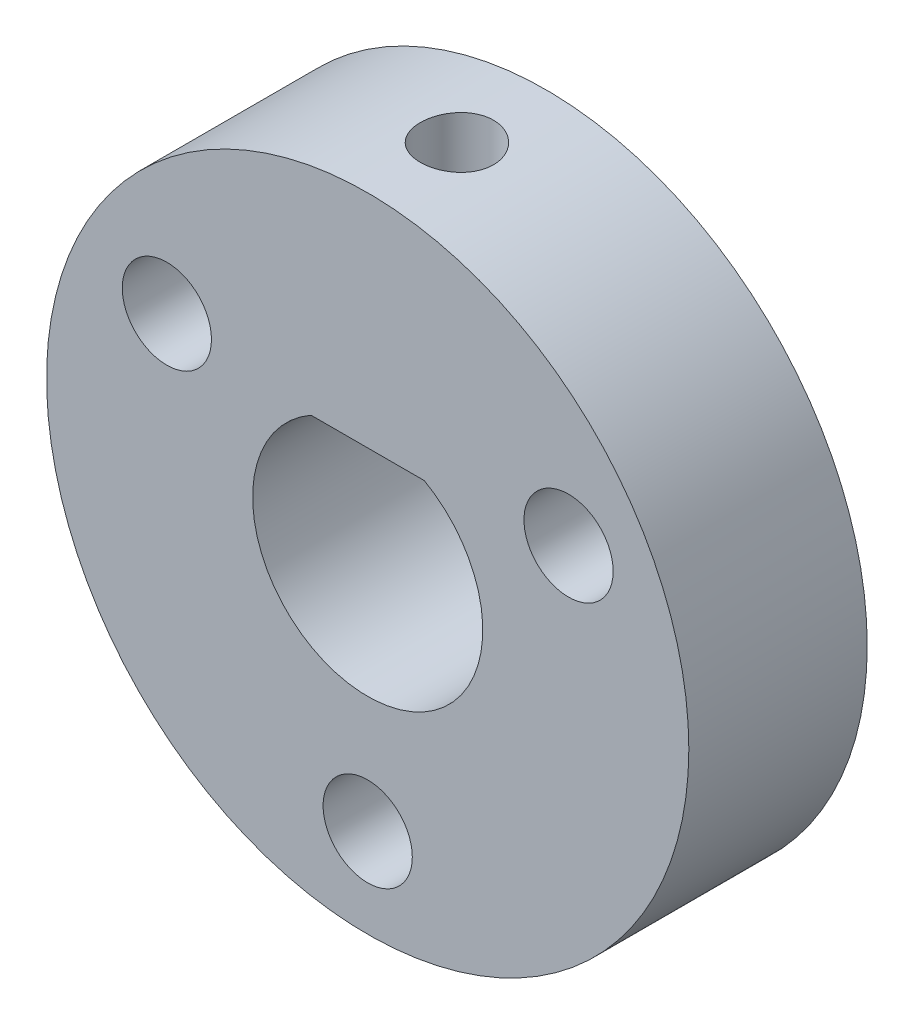
ISO-10303-21;
HEADER;
FILE_DESCRIPTION(('STEP AP214'),'2;1');
FILE_NAME('part.step','',(''),(''),'','','');
FILE_SCHEMA(('AUTOMOTIVE_DESIGN { 1 0 10303 214 1 1 1 1 }'));
ENDSEC;
DATA;
#1=APPLICATION_CONTEXT('core data for automotive mechanical design processes');
#2=APPLICATION_PROTOCOL_DEFINITION('international standard','automotive_design',2000,#1);
#3=PRODUCT_CONTEXT('',#1,'mechanical');
#4=PRODUCT('Part','Part','',(#3));
#5=PRODUCT_RELATED_PRODUCT_CATEGORY('part','',(#4));
#6=PRODUCT_DEFINITION_FORMATION('','',#4);
#7=PRODUCT_DEFINITION_CONTEXT('part definition',#1,'design');
#8=PRODUCT_DEFINITION('design','',#6,#7);
#9=PRODUCT_DEFINITION_SHAPE('','',#8);
#10=(LENGTH_UNIT() NAMED_UNIT(*) SI_UNIT(.MILLI.,.METRE.));
#11=(NAMED_UNIT(*) PLANE_ANGLE_UNIT() SI_UNIT($,.RADIAN.));
#12=(NAMED_UNIT(*) SI_UNIT($,.STERADIAN.) SOLID_ANGLE_UNIT());
#13=UNCERTAINTY_MEASURE_WITH_UNIT(LENGTH_MEASURE(1.E-05),#10,'distance_accuracy_value','');
#14=(GEOMETRIC_REPRESENTATION_CONTEXT(3) GLOBAL_UNCERTAINTY_ASSIGNED_CONTEXT((#13)) GLOBAL_UNIT_ASSIGNED_CONTEXT((#10,
#11,#12)) REPRESENTATION_CONTEXT('',''));
#15=CARTESIAN_POINT('',(0.,0.,0.));
#16=DIRECTION('',(0.,0.,1.));
#17=DIRECTION('',(1.,0.,0.));
#18=AXIS2_PLACEMENT_3D('',#15,#16,#17);
#19=CARTESIAN_POINT('',(0.,0.,2.5));
#20=DIRECTION('',(0.,0.,-1.));
#21=DIRECTION('',(-1.,0.,0.));
#22=AXIS2_PLACEMENT_3D('',#19,#20,#21);
#23=CYLINDRICAL_SURFACE('',#22,3.225);
#24=CARTESIAN_POINT('',(0.,0.,-2.5));
#25=DIRECTION('',(0.,0.,1.));
#26=DIRECTION('',(1.,0.,0.));
#27=AXIS2_PLACEMENT_3D('',#24,#25,#26);
#28=CIRCLE('',#27,3.225);
#29=CARTESIAN_POINT('',(-1.5875,2.80721726091872,-2.5));
#30=VERTEX_POINT('',#29);
#31=CARTESIAN_POINT('',(1.5875,2.80721726091872,-2.5));
#32=VERTEX_POINT('',#31);
#33=EDGE_CURVE('E91',#30,#32,#28,.T.);
#34=ORIENTED_EDGE('',*,*,#33,.F.);
#35=DIRECTION('',(0.,0.,-1.));
#36=VECTOR('',#35,1.);
#37=CARTESIAN_POINT('',(-1.5875,2.80721726091872,2.5));
#38=LINE('',#37,#36);
#39=CARTESIAN_POINT('',(-1.5875,2.80721726091872,2.5));
#40=VERTEX_POINT('',#39);
#41=EDGE_CURVE('E69',#40,#30,#38,.T.);
#42=ORIENTED_EDGE('',*,*,#41,.F.);
#43=CARTESIAN_POINT('',(0.,0.,2.5));
#44=DIRECTION('',(0.,0.,1.));
#45=DIRECTION('',(1.,0.,0.));
#46=AXIS2_PLACEMENT_3D('',#43,#44,#45);
#47=CIRCLE('',#46,3.225);
#48=CARTESIAN_POINT('',(1.5875,2.80721726091872,2.5));
#49=VERTEX_POINT('',#48);
#50=EDGE_CURVE('E92',#40,#49,#47,.T.);
#51=ORIENTED_EDGE('',*,*,#50,.T.);
#52=DIRECTION('',(0.,0.,-1.));
#53=VECTOR('',#52,1.);
#54=CARTESIAN_POINT('',(1.5875,2.80721726091872,2.5));
#55=LINE('',#54,#53);
#56=EDGE_CURVE('E89',#49,#32,#55,.T.);
#57=ORIENTED_EDGE('',*,*,#56,.T.);
#58=EDGE_LOOP('',(#34,#42,#51,#57));
#59=FACE_BOUND('',#58,.T.);
#60=ADVANCED_FACE('F56',(#59),#23,.F.);
#61=CARTESIAN_POINT('',(0.,2.80721726091872,2.5));
#62=DIRECTION('',(0.,1.,0.));
#63=DIRECTION('',(0.,0.,1.));
#64=AXIS2_PLACEMENT_3D('',#61,#62,#63);
#65=PLANE('',#64);
#66=CARTESIAN_POINT('',(0.,2.80721726091872,0.));
#67=DIRECTION('',(0.,-1.,0.));
#68=DIRECTION('',(0.,0.,-1.));
#69=AXIS2_PLACEMENT_3D('',#66,#67,#68);
#70=CIRCLE('',#69,1.02499999999999);
#71=CARTESIAN_POINT('',(0.,2.80721726091872,-1.02499999999999));
#72=VERTEX_POINT('',#71);
#73=EDGE_CURVE('E138',#72,#72,#70,.T.);
#74=ORIENTED_EDGE('',*,*,#73,.F.);
#75=EDGE_LOOP('',(#74));
#76=FACE_BOUND('',#75,.T.);
#77=DIRECTION('',(1.,0.,0.));
#78=VECTOR('',#77,1.);
#79=CARTESIAN_POINT('',(0.,2.80721726091872,-2.5));
#80=LINE('',#79,#78);
#81=EDGE_CURVE('E95',#30,#32,#80,.T.);
#82=ORIENTED_EDGE('',*,*,#81,.T.);
#83=ORIENTED_EDGE('',*,*,#56,.F.);
#84=DIRECTION('',(1.,0.,0.));
#85=VECTOR('',#84,1.);
#86=CARTESIAN_POINT('',(0.,2.80721726091872,2.5));
#87=LINE('',#86,#85);
#88=EDGE_CURVE('E76',#40,#49,#87,.T.);
#89=ORIENTED_EDGE('',*,*,#88,.F.);
#90=ORIENTED_EDGE('',*,*,#41,.T.);
#91=EDGE_LOOP('',(#82,#83,#89,#90));
#92=FACE_BOUND('',#91,.T.);
#93=ADVANCED_FACE('F96',(#76,#92),#65,.F.);
#94=CARTESIAN_POINT('',(0.,0.,2.5));
#95=DIRECTION('',(0.,0.,-1.));
#96=DIRECTION('',(-1.,0.,0.));
#97=AXIS2_PLACEMENT_3D('',#94,#95,#96);
#98=CYLINDRICAL_SURFACE('',#97,9.);
#99=CARTESIAN_POINT('',(0.,9.,-1.02499999999999));
#100=CARTESIAN_POINT('',(0.0573753909171978,8.99999925961503,-1.02499753903497));
#101=CARTESIAN_POINT('',(0.114787617838669,8.99944553282453,-1.02016630116377));
#102=CARTESIAN_POINT('',(0.228017265066316,8.99728986089473,-1.00096823747143));
#103=CARTESIAN_POINT('',(0.283832909917488,8.99568679279611,-0.986591195910849));
#104=CARTESIAN_POINT('',(0.392213555183772,8.99161320407462,-0.948728204063845));
#105=CARTESIAN_POINT('',(0.444780613102141,8.9891432392651,-0.925248089232633));
#106=CARTESIAN_POINT('',(0.545217193110308,8.98361126143477,-0.869857574385059));
#107=CARTESIAN_POINT('',(0.593087579036433,8.98054935759535,-0.837948728626057));
#108=CARTESIAN_POINT('',(0.68300321630072,8.97416011776361,-0.766449082337355));
#109=CARTESIAN_POINT('',(0.725023735205773,8.97083174324334,-0.72682726886319));
#110=CARTESIAN_POINT('',(0.801834013229898,8.96429316347879,-0.641092837012559));
#111=CARTESIAN_POINT('',(0.83662342038678,8.96108296399272,-0.594979902874857));
#112=CARTESIAN_POINT('',(0.898074105329194,8.9551338387168,-0.497414036417592));
#113=CARTESIAN_POINT('',(0.924712555999964,8.95239624564685,-0.445946638468025));
#114=CARTESIAN_POINT('',(0.968959398796378,8.94771566829622,-0.339232658020698));
#115=CARTESIAN_POINT('',(0.986568076686283,8.94577265886981,-0.283986195181325));
#116=CARTESIAN_POINT('',(1.01218115938201,8.94291095617809,-0.17153719021325));
#117=CARTESIAN_POINT('',(1.02022701929106,8.94198784286847,-0.114344204935616));
#118=CARTESIAN_POINT('',(1.02661428917342,8.94125684775775,0.000587192064597997));
#119=CARTESIAN_POINT('',(1.02495602546253,8.94144892845657,0.058325585381826));
#120=CARTESIAN_POINT('',(1.01201621308708,8.94292257606025,0.172421399835158));
#121=CARTESIAN_POINT('',(1.00078013832988,8.94419899460603,0.228784054146756));
#122=CARTESIAN_POINT('',(0.969074513894783,8.94768946508668,0.338818490874582));
#123=CARTESIAN_POINT('',(0.948604806359377,8.9499035330515,0.392490227269644));
#124=CARTESIAN_POINT('',(0.898963479394191,8.95502571613316,0.495761678078407));
#125=CARTESIAN_POINT('',(0.869771904058266,8.95793541980196,0.545351717932175));
#126=CARTESIAN_POINT('',(0.803529787699322,8.96411974836465,0.638946153543257));
#127=CARTESIAN_POINT('',(0.76647894812776,8.96739438711902,0.682950337010058));
#128=CARTESIAN_POINT('',(0.685317095630221,8.97396253637983,0.764388031644736));
#129=CARTESIAN_POINT('',(0.641166850260723,8.97725604752201,0.80178245432686));
#130=CARTESIAN_POINT('',(0.547195070661986,8.98347322348257,0.868635440961947));
#131=CARTESIAN_POINT('',(0.497373526848933,8.98639688767594,0.898093991503954));
#132=CARTESIAN_POINT('',(0.393444700195838,8.99154634521119,0.948238288041222));
#133=CARTESIAN_POINT('',(0.339336332839575,8.99377196124433,0.96892180559106));
#134=CARTESIAN_POINT('',(0.22838365156806,8.99727286722338,1.00089900334749));
#135=CARTESIAN_POINT('',(0.171539443967096,8.99854819406567,1.01219304811623));
#136=CARTESIAN_POINT('',(0.0570669058753071,9.00000005975213,1.02502054864318));
#137=CARTESIAN_POINT('',(-0.000555312037474565,9.00018266505917,1.02660789416907));
#138=CARTESIAN_POINT('',(-0.115244938527974,8.99944483947486,1.02011883453025));
#139=CARTESIAN_POINT('',(-0.172312356857049,8.99852442800598,1.01204259952681));
#140=CARTESIAN_POINT('',(-0.284115074416099,8.99568780848802,0.986500375493077));
#141=CARTESIAN_POINT('',(-0.338856268552935,8.99377430282565,0.969059863903665));
#142=CARTESIAN_POINT('',(-0.444636498503235,8.98916592075312,0.925310502203392));
#143=CARTESIAN_POINT('',(-0.495675428334906,8.98647102198567,0.899001398340001));
#144=CARTESIAN_POINT('',(-0.592844406702046,8.98058562738433,0.838129750928255));
#145=CARTESIAN_POINT('',(-0.638952327088667,8.9773930435774,0.803532089613502));
#146=CARTESIAN_POINT('',(-0.7247258565852,8.97087656141107,0.727115424148299));
#147=CARTESIAN_POINT('',(-0.764391254631444,8.96755265875398,0.685296183504036));
#148=CARTESIAN_POINT('',(-0.836343064995169,8.96112966043211,0.595387114184937));
#149=CARTESIAN_POINT('',(-0.868593919745587,8.95803169478937,0.547268737438232));
#150=CARTESIAN_POINT('',(-0.92455608664972,8.95242930034352,0.446266895828404));
#151=CARTESIAN_POINT('',(-0.948267544919371,8.94992486138494,0.393383512517731));
#152=CARTESIAN_POINT('',(-0.986419341965317,8.9458005120089,0.284470945906412));
#153=CARTESIAN_POINT('',(-1.00088024982937,8.94417864036495,0.22844904530096));
#154=CARTESIAN_POINT('',(-1.02018694032081,8.941997234298,0.114752663493763));
#155=CARTESIAN_POINT('',(-1.02503308867742,8.94143765946706,0.0570782452356616));
#156=CARTESIAN_POINT('',(-1.02496675961255,8.94144523521409,-0.057932436628715));
#157=CARTESIAN_POINT('',(-1.02011013828293,8.94200593668067,-0.115268740967333));
#158=CARTESIAN_POINT('',(-1.00089386343786,8.94417707787982,-0.228304868363955));
#159=CARTESIAN_POINT('',(-0.986534203919172,8.94578751827554,-0.28400469038814));
#160=CARTESIAN_POINT('',(-0.948735991734497,8.94987478495052,-0.392182613482724));
#161=CARTESIAN_POINT('',(-0.925299643066573,8.95235140089124,-0.444661493080122));
#162=CARTESIAN_POINT('',(-0.87001889320077,8.95789235396219,-0.544950225391719));
#163=CARTESIAN_POINT('',(-0.838174457954111,8.9609566934724,-0.592760059197412));
#164=CARTESIAN_POINT('',(-0.766772877913186,8.96734897238418,-0.682639544893087));
#165=CARTESIAN_POINT('',(-0.727174068829513,8.97067827537208,-0.724676002719955));
#166=CARTESIAN_POINT('',(-0.64147325315349,8.97721309119823,-0.801529916548373));
#167=CARTESIAN_POINT('',(-0.595369704695462,8.98041857445645,-0.836345656123705));
#168=CARTESIAN_POINT('',(-0.497802690400552,8.9863555969762,-0.897861412156021));
#169=CARTESIAN_POINT('',(-0.446322623385019,8.98908559445032,-0.924535230926674));
#170=CARTESIAN_POINT('',(-0.339613632364699,8.99374800397449,-0.968822689234305));
#171=CARTESIAN_POINT('',(-0.284388931414982,8.99568129765193,-0.986446348966327));
#172=CARTESIAN_POINT('',(-0.190721196128255,8.99805707224676,-1.00783125242076));
#173=CARTESIAN_POINT('',(-0.152872860454312,8.99878219277692,-1.01426049709498));
#174=CARTESIAN_POINT('',(-0.0766885010427325,8.99975390273272,-1.02284568111662));
#175=CARTESIAN_POINT('',(-0.0383524801096904,9.00000049490905,-1.02500164502778));
#176=CARTESIAN_POINT('',(0.,9.,-1.02499999999999));
#177=B_SPLINE_CURVE_WITH_KNOTS('',3,(#99,#100,#101,#102,#103,#104,#105,#106,#107,#108,#109,#110,
#111,#112,#113,#114,#115,#116,#117,#118,#119,#120,#121,#122,#123,#124,#125,#126,#127,#128,#129,
#130,#131,#132,#133,#134,#135,#136,#137,#138,#139,#140,#141,#142,#143,#144,#145,#146,#147,#148,
#149,#150,#151,#152,#153,#154,#155,#156,#157,#158,#159,#160,#161,#162,#163,#164,#165,#166,#167,
#168,#169,#170,#171,#172,#173,#174,#175,#176),.UNSPECIFIED.,.T.,.F.,(4,2,2,2,2,2,2,2,2,2,2,2,2,
2,2,2,2,2,2,2,2,2,2,2,2,2,2,2,2,2,2,2,2,2,2,2,2,2,4),(0.,0.171986102777505,0.344156559149437,
0.516216828979706,0.688245393030987,0.860980510321612,1.03372403323546,1.20694699531293,
1.38016447508335,1.5526282807524,1.72508628709906,1.89673002222447,2.06837669186988,
2.24041914179925,2.41246812824682,2.58550280336239,2.75853777089017,2.93161665489106,
3.10468881849795,3.27679923917788,3.44890662929406,3.62054812114215,3.79219452449805,
3.96458145439945,4.13697403073558,4.31017685497135,4.48337671542679,4.65619010575377,
4.828996922425,5.000811805727,5.17262679756772,5.34440009549103,5.51617408902577,
5.68889768556132,5.86166229302698,6.03497707142086,6.20809954240739,6.32306401404846,
6.43802782484736),.UNSPECIFIED.);
#178=CARTESIAN_POINT('',(0.,9.,-1.02499999999999));
#179=VERTEX_POINT('',#178);
#180=EDGE_CURVE('E12',#179,#179,#177,.T.);
#181=ORIENTED_EDGE('',*,*,#180,.T.);
#182=EDGE_LOOP('',(#181));
#183=FACE_BOUND('',#182,.T.);
#184=CARTESIAN_POINT('',(0.,0.,2.5));
#185=DIRECTION('',(0.,0.,1.));
#186=DIRECTION('',(1.,0.,0.));
#187=AXIS2_PLACEMENT_3D('',#184,#185,#186);
#188=CIRCLE('',#187,9.);
#189=CARTESIAN_POINT('',(9.,0.,2.5));
#190=VERTEX_POINT('',#189);
#191=EDGE_CURVE('E93',#190,#190,#188,.T.);
#192=ORIENTED_EDGE('',*,*,#191,.F.);
#193=EDGE_LOOP('',(#192));
#194=FACE_BOUND('',#193,.T.);
#195=CARTESIAN_POINT('',(0.,0.,-2.5));
#196=DIRECTION('',(0.,0.,1.));
#197=DIRECTION('',(1.,0.,0.));
#198=AXIS2_PLACEMENT_3D('',#195,#196,#197);
#199=CIRCLE('',#198,9.);
#200=CARTESIAN_POINT('',(9.,0.,-2.5));
#201=VERTEX_POINT('',#200);
#202=EDGE_CURVE('E98',#201,#201,#199,.T.);
#203=ORIENTED_EDGE('',*,*,#202,.T.);
#204=EDGE_LOOP('',(#203));
#205=FACE_BOUND('',#204,.T.);
#206=ADVANCED_FACE('F146',(#183,#194,#205),#98,.T.);
#207=CARTESIAN_POINT('',(0.,0.,2.5));
#208=DIRECTION('',(0.,0.,1.));
#209=DIRECTION('',(1.,0.,0.));
#210=AXIS2_PLACEMENT_3D('',#207,#208,#209);
#211=PLANE('',#210);
#212=CARTESIAN_POINT('',(5.62916512459888,3.24999999999995,2.5));
#213=DIRECTION('',(0.,0.,1.));
#214=DIRECTION('',(1.,0.,0.));
#215=AXIS2_PLACEMENT_3D('',#212,#213,#214);
#216=CIRCLE('',#215,1.24999999999999);
#217=CARTESIAN_POINT('',(6.87916512459887,3.24999999999995,2.5));
#218=VERTEX_POINT('',#217);
#219=EDGE_CURVE('E134',#218,#218,#216,.T.);
#220=ORIENTED_EDGE('',*,*,#219,.F.);
#221=EDGE_LOOP('',(#220));
#222=FACE_BOUND('',#221,.T.);
#223=CARTESIAN_POINT('',(-5.62916512459884,3.25000000000003,2.5));
#224=DIRECTION('',(0.,0.,1.));
#225=DIRECTION('',(1.,0.,0.));
#226=AXIS2_PLACEMENT_3D('',#223,#224,#225);
#227=CIRCLE('',#226,1.24999999999999);
#228=CARTESIAN_POINT('',(-4.37916512459885,3.25000000000003,2.5));
#229=VERTEX_POINT('',#228);
#230=EDGE_CURVE('E127',#229,#229,#227,.T.);
#231=ORIENTED_EDGE('',*,*,#230,.F.);
#232=EDGE_LOOP('',(#231));
#233=FACE_BOUND('',#232,.T.);
#234=CARTESIAN_POINT('',(0.,-6.5,2.5));
#235=DIRECTION('',(0.,0.,1.));
#236=DIRECTION('',(1.,0.,0.));
#237=AXIS2_PLACEMENT_3D('',#234,#235,#236);
#238=CIRCLE('',#237,1.24999999999999);
#239=CARTESIAN_POINT('',(1.24999999999999,-6.5,2.5));
#240=VERTEX_POINT('',#239);
#241=EDGE_CURVE('E105',#240,#240,#238,.T.);
#242=ORIENTED_EDGE('',*,*,#241,.F.);
#243=EDGE_LOOP('',(#242));
#244=FACE_BOUND('',#243,.T.);
#245=ORIENTED_EDGE('',*,*,#50,.F.);
#246=ORIENTED_EDGE('',*,*,#88,.T.);
#247=EDGE_LOOP('',(#245,#246));
#248=FACE_BOUND('',#247,.T.);
#249=ORIENTED_EDGE('',*,*,#191,.T.);
#250=EDGE_LOOP('',(#249));
#251=FACE_BOUND('',#250,.T.);
#252=ADVANCED_FACE('F151',(#222,#233,#244,#248,#251),#211,.T.);
#253=CARTESIAN_POINT('',(0.,0.,-2.5));
#254=DIRECTION('',(0.,0.,1.));
#255=DIRECTION('',(1.,0.,0.));
#256=AXIS2_PLACEMENT_3D('',#253,#254,#255);
#257=PLANE('',#256);
#258=CARTESIAN_POINT('',(5.62916512459888,3.24999999999995,-2.5));
#259=DIRECTION('',(0.,0.,1.));
#260=DIRECTION('',(1.,0.,0.));
#261=AXIS2_PLACEMENT_3D('',#258,#259,#260);
#262=CIRCLE('',#261,1.24999999999999);
#263=CARTESIAN_POINT('',(6.87916512459887,3.24999999999995,-2.5));
#264=VERTEX_POINT('',#263);
#265=EDGE_CURVE('E131',#264,#264,#262,.T.);
#266=ORIENTED_EDGE('',*,*,#265,.T.);
#267=EDGE_LOOP('',(#266));
#268=FACE_BOUND('',#267,.T.);
#269=CARTESIAN_POINT('',(-5.62916512459884,3.25000000000003,-2.5));
#270=DIRECTION('',(0.,0.,1.));
#271=DIRECTION('',(1.,0.,0.));
#272=AXIS2_PLACEMENT_3D('',#269,#270,#271);
#273=CIRCLE('',#272,1.24999999999999);
#274=CARTESIAN_POINT('',(-4.37916512459885,3.25000000000003,-2.5));
#275=VERTEX_POINT('',#274);
#276=EDGE_CURVE('E125',#275,#275,#273,.T.);
#277=ORIENTED_EDGE('',*,*,#276,.T.);
#278=EDGE_LOOP('',(#277));
#279=FACE_BOUND('',#278,.T.);
#280=CARTESIAN_POINT('',(0.,-6.5,-2.5));
#281=DIRECTION('',(0.,0.,1.));
#282=DIRECTION('',(1.,0.,0.));
#283=AXIS2_PLACEMENT_3D('',#280,#281,#282);
#284=CIRCLE('',#283,1.24999999999999);
#285=CARTESIAN_POINT('',(1.24999999999999,-6.5,-2.5));
#286=VERTEX_POINT('',#285);
#287=EDGE_CURVE('E102',#286,#286,#284,.T.);
#288=ORIENTED_EDGE('',*,*,#287,.T.);
#289=EDGE_LOOP('',(#288));
#290=FACE_BOUND('',#289,.T.);
#291=ORIENTED_EDGE('',*,*,#33,.T.);
#292=ORIENTED_EDGE('',*,*,#81,.F.);
#293=EDGE_LOOP('',(#291,#292));
#294=FACE_BOUND('',#293,.T.);
#295=ORIENTED_EDGE('',*,*,#202,.F.);
#296=EDGE_LOOP('',(#295));
#297=FACE_BOUND('',#296,.T.);
#298=ADVANCED_FACE('F100',(#268,#279,#290,#294,#297),#257,.F.);
#299=CARTESIAN_POINT('',(0.,-6.5,2.5));
#300=DIRECTION('',(0.,0.,1.));
#301=DIRECTION('',(1.,0.,0.));
#302=AXIS2_PLACEMENT_3D('',#299,#300,#301);
#303=CYLINDRICAL_SURFACE('',#302,1.24999999999999);
#304=ORIENTED_EDGE('',*,*,#287,.F.);
#305=EDGE_LOOP('',(#304));
#306=FACE_BOUND('',#305,.T.);
#307=ORIENTED_EDGE('',*,*,#241,.T.);
#308=EDGE_LOOP('',(#307));
#309=FACE_BOUND('',#308,.T.);
#310=ADVANCED_FACE('F158',(#306,#309),#303,.F.);
#311=CARTESIAN_POINT('',(-5.62916512459884,3.25000000000003,2.5));
#312=DIRECTION('',(0.,0.,1.));
#313=DIRECTION('',(1.,0.,0.));
#314=AXIS2_PLACEMENT_3D('',#311,#312,#313);
#315=CYLINDRICAL_SURFACE('',#314,1.24999999999999);
#316=ORIENTED_EDGE('',*,*,#276,.F.);
#317=EDGE_LOOP('',(#316));
#318=FACE_BOUND('',#317,.T.);
#319=ORIENTED_EDGE('',*,*,#230,.T.);
#320=EDGE_LOOP('',(#319));
#321=FACE_BOUND('',#320,.T.);
#322=ADVANCED_FACE('F165',(#318,#321),#315,.F.);
#323=CARTESIAN_POINT('',(5.62916512459888,3.24999999999995,2.5));
#324=DIRECTION('',(0.,0.,1.));
#325=DIRECTION('',(1.,0.,0.));
#326=AXIS2_PLACEMENT_3D('',#323,#324,#325);
#327=CYLINDRICAL_SURFACE('',#326,1.24999999999999);
#328=ORIENTED_EDGE('',*,*,#265,.F.);
#329=EDGE_LOOP('',(#328));
#330=FACE_BOUND('',#329,.T.);
#331=ORIENTED_EDGE('',*,*,#219,.T.);
#332=EDGE_LOOP('',(#331));
#333=FACE_BOUND('',#332,.T.);
#334=ADVANCED_FACE('F169',(#330,#333),#327,.F.);
#335=CARTESIAN_POINT('',(0.,2.80721726091872,0.));
#336=DIRECTION('',(0.,-1.,0.));
#337=DIRECTION('',(0.,0.,-1.));
#338=AXIS2_PLACEMENT_3D('',#335,#336,#337);
#339=CYLINDRICAL_SURFACE('',#338,1.02499999999999);
#340=ORIENTED_EDGE('',*,*,#73,.T.);
#341=EDGE_LOOP('',(#340));
#342=FACE_BOUND('',#341,.T.);
#343=ORIENTED_EDGE('',*,*,#180,.F.);
#344=EDGE_LOOP('',(#343));
#345=FACE_BOUND('',#344,.T.);
#346=ADVANCED_FACE('F142',(#342,#345),#339,.F.);
#347=CLOSED_SHELL('',(#60,#93,#206,#252,#298,#310,#322,#334,#346));
#348=MANIFOLD_SOLID_BREP('B2',#347);
#349=ADVANCED_BREP_SHAPE_REPRESENTATION('',(#18,#348),#14);
#350=SHAPE_DEFINITION_REPRESENTATION(#9,#349);
ENDSEC;
END-ISO-10303-21;
